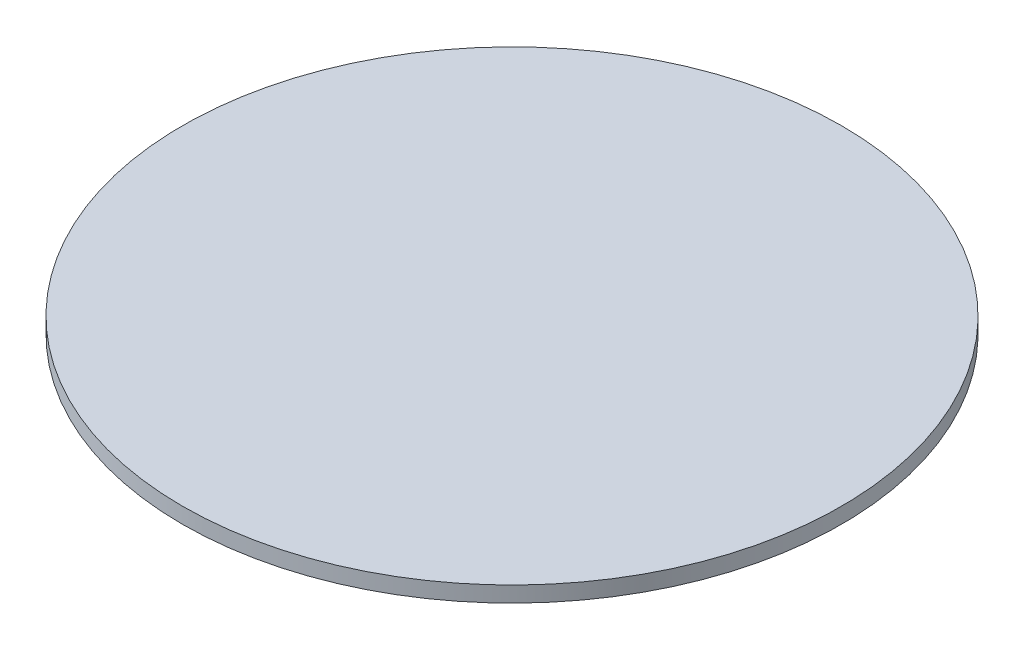
ISO-10303-21;
HEADER;
FILE_DESCRIPTION(('STEP AP214'),'2;1');
FILE_NAME('part.step','',(''),(''),'','','');
FILE_SCHEMA(('AUTOMOTIVE_DESIGN { 1 0 10303 214 1 1 1 1 }'));
ENDSEC;
DATA;
#1=APPLICATION_CONTEXT('core data for automotive mechanical design processes');
#2=APPLICATION_PROTOCOL_DEFINITION('international standard','automotive_design',2000,#1);
#3=PRODUCT_CONTEXT('',#1,'mechanical');
#4=PRODUCT('Part','Part','',(#3));
#5=PRODUCT_RELATED_PRODUCT_CATEGORY('part','',(#4));
#6=PRODUCT_DEFINITION_FORMATION('','',#4);
#7=PRODUCT_DEFINITION_CONTEXT('part definition',#1,'design');
#8=PRODUCT_DEFINITION('design','',#6,#7);
#9=PRODUCT_DEFINITION_SHAPE('','',#8);
#10=(LENGTH_UNIT() NAMED_UNIT(*) SI_UNIT(.MILLI.,.METRE.));
#11=(NAMED_UNIT(*) PLANE_ANGLE_UNIT() SI_UNIT($,.RADIAN.));
#12=(NAMED_UNIT(*) SI_UNIT($,.STERADIAN.) SOLID_ANGLE_UNIT());
#13=UNCERTAINTY_MEASURE_WITH_UNIT(LENGTH_MEASURE(1.E-05),#10,'distance_accuracy_value','');
#14=(GEOMETRIC_REPRESENTATION_CONTEXT(3) GLOBAL_UNCERTAINTY_ASSIGNED_CONTEXT((#13)) GLOBAL_UNIT_ASSIGNED_CONTEXT((#10,
#11,#12)) REPRESENTATION_CONTEXT('',''));
#15=CARTESIAN_POINT('',(0.,0.,0.));
#16=DIRECTION('',(0.,0.,1.));
#17=DIRECTION('',(1.,0.,0.));
#18=AXIS2_PLACEMENT_3D('',#15,#16,#17);
#19=CARTESIAN_POINT('',(0.,4.,0.));
#20=DIRECTION('',(0.,-1.,0.));
#21=DIRECTION('',(0.,0.,-1.));
#22=AXIS2_PLACEMENT_3D('',#19,#20,#21);
#23=CYLINDRICAL_SURFACE('',#22,84.);
#24=CARTESIAN_POINT('',(0.,4.,0.));
#25=DIRECTION('',(0.,1.,0.));
#26=DIRECTION('',(0.,0.,1.));
#27=AXIS2_PLACEMENT_3D('',#24,#25,#26);
#28=CIRCLE('',#27,84.);
#29=CARTESIAN_POINT('',(0.,4.,84.));
#30=VERTEX_POINT('',#29);
#31=EDGE_CURVE('E10',#30,#30,#28,.T.);
#32=ORIENTED_EDGE('',*,*,#31,.F.);
#33=EDGE_LOOP('',(#32));
#34=FACE_BOUND('',#33,.T.);
#35=CARTESIAN_POINT('',(0.,0.,0.));
#36=DIRECTION('',(0.,1.,0.));
#37=DIRECTION('',(0.,0.,1.));
#38=AXIS2_PLACEMENT_3D('',#35,#36,#37);
#39=CIRCLE('',#38,84.);
#40=CARTESIAN_POINT('',(0.,0.,84.));
#41=VERTEX_POINT('',#40);
#42=EDGE_CURVE('E33',#41,#41,#39,.T.);
#43=ORIENTED_EDGE('',*,*,#42,.T.);
#44=EDGE_LOOP('',(#43));
#45=FACE_BOUND('',#44,.T.);
#46=ADVANCED_FACE('F30',(#34,#45),#23,.T.);
#47=CARTESIAN_POINT('',(0.,4.,0.));
#48=DIRECTION('',(0.,1.,0.));
#49=DIRECTION('',(0.,0.,1.));
#50=AXIS2_PLACEMENT_3D('',#47,#48,#49);
#51=PLANE('',#50);
#52=ORIENTED_EDGE('',*,*,#31,.T.);
#53=EDGE_LOOP('',(#52));
#54=FACE_BOUND('',#53,.T.);
#55=ADVANCED_FACE('F45',(#54),#51,.T.);
#56=CARTESIAN_POINT('',(0.,0.,0.));
#57=DIRECTION('',(0.,1.,0.));
#58=DIRECTION('',(0.,0.,1.));
#59=AXIS2_PLACEMENT_3D('',#56,#57,#58);
#60=PLANE('',#59);
#61=ORIENTED_EDGE('',*,*,#42,.F.);
#62=EDGE_LOOP('',(#61));
#63=FACE_BOUND('',#62,.T.);
#64=ADVANCED_FACE('F43',(#63),#60,.F.);
#65=CLOSED_SHELL('',(#46,#55,#64));
#66=MANIFOLD_SOLID_BREP('B2',#65);
#67=ADVANCED_BREP_SHAPE_REPRESENTATION('',(#18,#66),#14);
#68=SHAPE_DEFINITION_REPRESENTATION(#9,#67);
ENDSEC;
END-ISO-10303-21;
